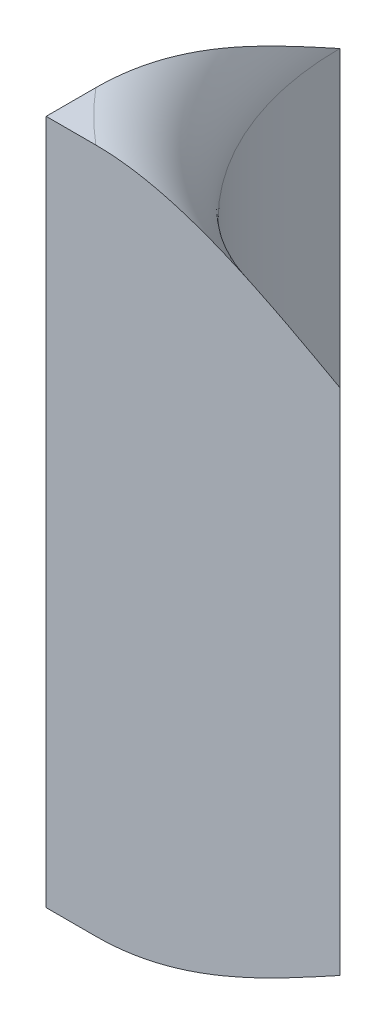
ISO-10303-21;
HEADER;
FILE_DESCRIPTION(('STEP AP214'),'2;1');
FILE_NAME('part.step','',(''),(''),'','','');
FILE_SCHEMA(('AUTOMOTIVE_DESIGN { 1 0 10303 214 1 1 1 1 }'));
ENDSEC;
DATA;
#1=APPLICATION_CONTEXT('core data for automotive mechanical design processes');
#2=APPLICATION_PROTOCOL_DEFINITION('international standard','automotive_design',2000,#1);
#3=PRODUCT_CONTEXT('',#1,'mechanical');
#4=PRODUCT('Part','Part','',(#3));
#5=PRODUCT_RELATED_PRODUCT_CATEGORY('part','',(#4));
#6=PRODUCT_DEFINITION_FORMATION('','',#4);
#7=PRODUCT_DEFINITION_CONTEXT('part definition',#1,'design');
#8=PRODUCT_DEFINITION('design','',#6,#7);
#9=PRODUCT_DEFINITION_SHAPE('','',#8);
#10=(LENGTH_UNIT() NAMED_UNIT(*) SI_UNIT(.MILLI.,.METRE.));
#11=(NAMED_UNIT(*) PLANE_ANGLE_UNIT() SI_UNIT($,.RADIAN.));
#12=(NAMED_UNIT(*) SI_UNIT($,.STERADIAN.) SOLID_ANGLE_UNIT());
#13=UNCERTAINTY_MEASURE_WITH_UNIT(LENGTH_MEASURE(1.E-05),#10,'distance_accuracy_value','');
#14=(GEOMETRIC_REPRESENTATION_CONTEXT(3) GLOBAL_UNCERTAINTY_ASSIGNED_CONTEXT((#13)) GLOBAL_UNIT_ASSIGNED_CONTEXT((#10,
#11,#12)) REPRESENTATION_CONTEXT('',''));
#15=CARTESIAN_POINT('',(0.,0.,0.));
#16=DIRECTION('',(0.,0.,1.));
#17=DIRECTION('',(1.,0.,0.));
#18=AXIS2_PLACEMENT_3D('',#15,#16,#17);
#19=CARTESIAN_POINT('',(0.899999999999998,2.46,-7.3));
#20=DIRECTION('',(0.,1.,0.));
#21=DIRECTION('',(0.,0.,1.));
#22=AXIS2_PLACEMENT_3D('',#19,#20,#21);
#23=TOROIDAL_SURFACE('',#22,0.389999999999998,0.0899999999999998);
#24=CARTESIAN_POINT('',(0.6,2.55,-7.05080128411138));
#25=CARTESIAN_POINT('',(0.6,2.54996873881584,-7.06539050320358));
#26=CARTESIAN_POINT('',(0.6,2.54856309488377,-7.07987147393059));
#27=CARTESIAN_POINT('',(0.6,2.54368423695863,-7.10829216976645));
#28=CARTESIAN_POINT('',(0.6,2.54023956259986,-7.12223658857574));
#29=CARTESIAN_POINT('',(0.6,2.52752219042688,-7.16420253695043));
#30=CARTESIAN_POINT('',(0.6,2.515942208103,-7.19147802039733));
#31=CARTESIAN_POINT('',(0.6,2.49015615109007,-7.24483565452281));
#32=CARTESIAN_POINT('',(0.599999999999999,2.47593214013189,-7.27090803790901));
#33=CARTESIAN_POINT('',(0.6,2.46110939531162,-7.29797451018031));
#34=CARTESIAN_POINT('',(0.6,2.46055469450969,-7.29898724918841));
#35=CARTESIAN_POINT('',(0.6,2.46,-7.3));
#36=B_SPLINE_CURVE_WITH_KNOTS('',3,(#24,#25,#26,#27,#28,#29,#30,#31,#32,#33,#34,#35),
.UNSPECIFIED.,.F.,.F.,(4,2,2,2,2,4),(0.,0.0435527295939666,0.0865098187320564,0.17500096336577,
0.264115894109952,0.267579995726727),.UNSPECIFIED.);
#37=CARTESIAN_POINT('',(0.6,2.55,-7.05080128411192));
#38=VERTEX_POINT('',#37);
#39=CARTESIAN_POINT('',(0.6,2.46,-7.3));
#40=VERTEX_POINT('',#39);
#41=EDGE_CURVE('E67',#38,#40,#36,.T.);
#42=ORIENTED_EDGE('',*,*,#41,.F.);
#43=CARTESIAN_POINT('',(0.899999999999998,2.55,-7.3));
#44=DIRECTION('',(0.,1.,0.));
#45=DIRECTION('',(0.,0.,1.));
#46=AXIS2_PLACEMENT_3D('',#43,#44,#45);
#47=CIRCLE('',#46,0.39);
#48=CARTESIAN_POINT('',(0.650801284112227,2.55,-7.));
#49=VERTEX_POINT('',#48);
#50=EDGE_CURVE('E21',#49,#38,#47,.F.);
#51=ORIENTED_EDGE('',*,*,#50,.F.);
#52=CARTESIAN_POINT('',(0.899999999999998,2.46,-7.));
#53=CARTESIAN_POINT('',(0.89898725661567,2.46055469331149,-7.));
#54=CARTESIAN_POINT('',(0.89797451732508,2.46110939416546,-7.));
#55=CARTESIAN_POINT('',(0.870492029190443,2.47615989168935,-7.));
#56=CARTESIAN_POINT('',(0.843998347949796,2.49061098047862,-7.));
#57=CARTESIAN_POINT('',(0.789677174911872,2.51675946724636,-7.));
#58=CARTESIAN_POINT('',(0.761855684111753,2.52846806008301,-7.));
#59=CARTESIAN_POINT('',(0.713737421333795,2.54263860606332,-7.));
#60=CARTESIAN_POINT('',(0.694027278119801,2.54688228554532,-7.));
#61=CARTESIAN_POINT('',(0.664024458957082,2.54981614838479,-7.));
#62=CARTESIAN_POINT('',(0.653905975180585,2.55021635400833,-7.));
#63=CARTESIAN_POINT('',(0.633709860349571,2.54955798089519,-7.));
#64=CARTESIAN_POINT('',(0.623632190714962,2.54850159887963,-7.));
#65=CARTESIAN_POINT('',(0.606849795189301,2.54519918623928,-7.));
#66=CARTESIAN_POINT('',(0.600054941578323,2.5434150242651,-7.));
#67=CARTESIAN_POINT('',(0.586796003818043,2.53886646101217,-7.));
#68=CARTESIAN_POINT('',(0.580331618137324,2.53610297225817,-7.));
#69=CARTESIAN_POINT('',(0.569145675850515,2.53012138519625,-7.));
#70=CARTESIAN_POINT('',(0.564325822863426,2.52708831558089,-7.));
#71=CARTESIAN_POINT('',(0.555238755963973,2.52028079794345,-7.));
#72=CARTESIAN_POINT('',(0.550970850404855,2.51650729299449,-7.));
#73=CARTESIAN_POINT('',(0.543952593766598,2.50903441492667,-7.));
#74=CARTESIAN_POINT('',(0.541068318756381,2.5054611748476,-7.));
#75=CARTESIAN_POINT('',(0.535926389086217,2.49788615695023,-7.));
#76=CARTESIAN_POINT('',(0.533668467919015,2.49388456239999,-7.));
#77=CARTESIAN_POINT('',(0.529891428907988,2.4855116190311,-7.));
#78=CARTESIAN_POINT('',(0.528377215587005,2.48113803302174,-7.));
#79=CARTESIAN_POINT('',(0.526212037434973,2.4721811284973,-7.));
#80=CARTESIAN_POINT('',(0.525560657993527,2.46759791181045,-7.));
#81=CARTESIAN_POINT('',(0.525189588582738,2.4589137667806,-7.));
#82=CARTESIAN_POINT('',(0.525373142459925,2.45481671703714,-7.));
#83=CARTESIAN_POINT('',(0.526443915780497,2.44671856100796,-7.));
#84=CARTESIAN_POINT('',(0.527330688055962,2.44271739541587,-7.));
#85=CARTESIAN_POINT('',(0.52972859349771,2.43501262320044,-7.));
#86=CARTESIAN_POINT('',(0.531224520104254,2.43130422631036,-7.));
#87=CARTESIAN_POINT('',(0.53476988704398,2.42415641295072,-7.));
#88=CARTESIAN_POINT('',(0.536820278802693,2.4207174720548,-7.));
#89=CARTESIAN_POINT('',(0.541601274235801,2.4138664688397,-7.));
#90=CARTESIAN_POINT('',(0.544377293154097,2.41048640398364,-7.));
#91=CARTESIAN_POINT('',(0.55036767495299,2.4041646567645,-7.));
#92=CARTESIAN_POINT('',(0.553580180020798,2.40122122144443,-7.));
#93=CARTESIAN_POINT('',(0.556962532803208,2.39850407393579,-7.));
#94=B_SPLINE_CURVE_WITH_KNOTS('',3,(#52,#53,#54,#55,#56,#57,#58,#59,#60,#61,#62,#63,#64,#65,#66,
#67,#68,#69,#70,#71,#72,#73,#74,#75,#76,#77,#78,#79,#80,#81,#82,#83,#84,#85,#86,#87,#88,#89,#90,
#91,#92,#93),.UNSPECIFIED.,.F.,.F.,(4,2,2,2,2,2,2,2,2,2,2,2,2,2,2,2,2,2,2,2,4),(0.,
0.00346410161608666,0.0940013231416879,0.184162267738062,0.244240211028066,0.274541767257815,
0.304797674800989,0.325813063735658,0.346808922053302,0.36383106331407,0.380831663025104,
0.394552608315526,0.408267706495753,0.422072076080095,0.435869809956166,0.448112045059994,
0.460346501713522,0.472292633881971,0.48425939634464,0.497334648987101,0.510355897946322),.UNSPECIFIED.);
#95=CARTESIAN_POINT('',(0.899999999999995,2.46,-7.));
#96=VERTEX_POINT('',#95);
#97=EDGE_CURVE('E64',#96,#49,#94,.T.);
#98=ORIENTED_EDGE('',*,*,#97,.F.);
#99=CARTESIAN_POINT('',(0.899999999999999,2.46,-7.3));
#100=DIRECTION('',(0.,1.,0.));
#101=DIRECTION('',(0.,0.,1.));
#102=AXIS2_PLACEMENT_3D('',#99,#100,#101);
#103=CIRCLE('',#102,0.299999999999999);
#104=EDGE_CURVE('E71',#40,#96,#103,.T.);
#105=ORIENTED_EDGE('',*,*,#104,.F.);
#106=EDGE_LOOP('',(#42,#51,#98,#105));
#107=FACE_BOUND('',#106,.T.);
#108=ADVANCED_FACE('F17',(#107),#23,.T.);
#109=CARTESIAN_POINT('',(0.599,2.55,-7.051801284111));
#110=DIRECTION('',(0.,1.,0.));
#111=DIRECTION('',(0.,0.,1.));
#112=AXIS2_PLACEMENT_3D('',#109,#110,#111);
#113=PLANE('',#112);
#114=DIRECTION('',(-1.,0.,0.));
#115=VECTOR('',#114,1.);
#116=CARTESIAN_POINT('',(0.75,2.55,-7.));
#117=LINE('',#116,#115);
#118=CARTESIAN_POINT('',(0.6,2.55,-7.));
#119=VERTEX_POINT('',#118);
#120=EDGE_CURVE('E73',#49,#119,#117,.T.);
#121=ORIENTED_EDGE('',*,*,#120,.F.);
#122=ORIENTED_EDGE('',*,*,#50,.T.);
#123=DIRECTION('',(0.,0.,-1.));
#124=VECTOR('',#123,1.);
#125=CARTESIAN_POINT('',(0.6,2.55,-7.15));
#126=LINE('',#125,#124);
#127=EDGE_CURVE('E75',#119,#38,#126,.T.);
#128=ORIENTED_EDGE('',*,*,#127,.F.);
#129=EDGE_LOOP('',(#121,#122,#128));
#130=FACE_BOUND('',#129,.T.);
#131=ADVANCED_FACE('F74',(#130),#113,.T.);
#132=CARTESIAN_POINT('',(0.899999999999999,2.46,-7.3));
#133=DIRECTION('',(0.,-1.,0.));
#134=DIRECTION('',(0.,0.,-1.));
#135=AXIS2_PLACEMENT_3D('',#132,#133,#134);
#136=CYLINDRICAL_SURFACE('',#135,0.299999999999999);
#137=CARTESIAN_POINT('',(0.899999999999999,1.94,-7.3));
#138=DIRECTION('',(0.,1.,0.));
#139=DIRECTION('',(0.,0.,1.));
#140=AXIS2_PLACEMENT_3D('',#137,#138,#139);
#141=CIRCLE('',#140,0.299999999999999);
#142=CARTESIAN_POINT('',(0.6,1.94,-7.3));
#143=VERTEX_POINT('',#142);
#144=CARTESIAN_POINT('',(0.9,1.94,-7.));
#145=VERTEX_POINT('',#144);
#146=EDGE_CURVE('E122',#143,#145,#141,.T.);
#147=ORIENTED_EDGE('',*,*,#146,.F.);
#148=DIRECTION('',(0.,-1.,0.));
#149=VECTOR('',#148,1.);
#150=CARTESIAN_POINT('',(0.6,2.20000000000024,-7.3));
#151=LINE('',#150,#149);
#152=EDGE_CURVE('E82',#40,#143,#151,.T.);
#153=ORIENTED_EDGE('',*,*,#152,.F.);
#154=ORIENTED_EDGE('',*,*,#104,.T.);
#155=DIRECTION('',(0.,1.,0.));
#156=VECTOR('',#155,1.);
#157=CARTESIAN_POINT('',(0.9,2.19999999999995,-7.));
#158=LINE('',#157,#156);
#159=EDGE_CURVE('E78',#145,#96,#158,.T.);
#160=ORIENTED_EDGE('',*,*,#159,.F.);
#161=EDGE_LOOP('',(#147,#153,#154,#160));
#162=FACE_BOUND('',#161,.T.);
#163=ADVANCED_FACE('F102',(#162),#136,.F.);
#164=CARTESIAN_POINT('',(0.599,2.55100000000009,-7.));
#165=DIRECTION('',(0.,0.,1.));
#166=DIRECTION('',(0.,-1.,0.));
#167=AXIS2_PLACEMENT_3D('',#164,#165,#166);
#168=PLANE('',#167);
#169=ORIENTED_EDGE('',*,*,#159,.T.);
#170=ORIENTED_EDGE('',*,*,#97,.T.);
#171=ORIENTED_EDGE('',*,*,#120,.T.);
#172=DIRECTION('',(0.,1.,0.));
#173=VECTOR('',#172,1.);
#174=CARTESIAN_POINT('',(0.6,2.20000000000024,-7.));
#175=LINE('',#174,#173);
#176=CARTESIAN_POINT('',(0.6,1.85,-7.));
#177=VERTEX_POINT('',#176);
#178=EDGE_CURVE('E133',#177,#119,#175,.T.);
#179=ORIENTED_EDGE('',*,*,#178,.F.);
#180=DIRECTION('',(-1.,0.,0.));
#181=VECTOR('',#180,1.);
#182=CARTESIAN_POINT('',(0.625400642056094,1.85,-7.));
#183=LINE('',#182,#181);
#184=CARTESIAN_POINT('',(0.65080128411216,1.84999999999969,-7.));
#185=VERTEX_POINT('',#184);
#186=EDGE_CURVE('E120',#185,#177,#183,.T.);
#187=ORIENTED_EDGE('',*,*,#186,.F.);
#188=CARTESIAN_POINT('',(0.899999999999999,1.94,-7.));
#189=CARTESIAN_POINT('',(0.898987256615678,1.9394453066885,-7.));
#190=CARTESIAN_POINT('',(0.897974517325094,1.93889060583452,-7.));
#191=CARTESIAN_POINT('',(0.870492029190653,1.92384010831033,-6.99999999999999));
#192=CARTESIAN_POINT('',(0.8439983479499,1.90938901952132,-7.));
#193=CARTESIAN_POINT('',(0.789677174911932,1.88324053275377,-7.));
#194=CARTESIAN_POINT('',(0.76185568411187,1.87153193991706,-7.));
#195=CARTESIAN_POINT('',(0.713737421333924,1.8573613939367,-7.));
#196=CARTESIAN_POINT('',(0.694027278119896,1.85311771445469,-7.));
#197=CARTESIAN_POINT('',(0.664024458957132,1.85018385161522,-7.));
#198=CARTESIAN_POINT('',(0.653905975180621,1.84978364599167,-7.));
#199=CARTESIAN_POINT('',(0.633709860349576,1.8504420191048,-7.));
#200=CARTESIAN_POINT('',(0.623632190714951,1.85149840112037,-7.));
#201=CARTESIAN_POINT('',(0.606849795189277,1.85480081376073,-7.));
#202=CARTESIAN_POINT('',(0.600054941578301,1.85658497573491,-7.));
#203=CARTESIAN_POINT('',(0.586796003818025,1.86113353898784,-7.));
#204=CARTESIAN_POINT('',(0.580331618137308,1.86389702774184,-7.));
#205=CARTESIAN_POINT('',(0.569145675850502,1.86987861480375,-7.));
#206=CARTESIAN_POINT('',(0.564325822863414,1.87291168441911,-7.));
#207=CARTESIAN_POINT('',(0.555238755963963,1.87971920205656,-7.));
#208=CARTESIAN_POINT('',(0.550970850404846,1.88349270700552,-7.));
#209=CARTESIAN_POINT('',(0.54395259376659,1.89096558507334,-7.));
#210=CARTESIAN_POINT('',(0.541068318756374,1.89453882515241,-7.));
#211=CARTESIAN_POINT('',(0.535926389086211,1.90211384304978,-7.));
#212=CARTESIAN_POINT('',(0.533668467919011,1.90611543760003,-7.));
#213=CARTESIAN_POINT('',(0.529891428907985,1.91448838096891,-7.));
#214=CARTESIAN_POINT('',(0.528377215587003,1.91886196697827,-7.));
#215=CARTESIAN_POINT('',(0.526212037434972,1.92781887150271,-7.));
#216=CARTESIAN_POINT('',(0.525560657993526,1.93240208818956,-7.));
#217=CARTESIAN_POINT('',(0.525189588582739,1.94108623321941,-7.));
#218=CARTESIAN_POINT('',(0.525373142459927,1.94518328296287,-7.));
#219=CARTESIAN_POINT('',(0.526443915780499,1.95328143899205,-7.));
#220=CARTESIAN_POINT('',(0.527330688055965,1.95728260458414,-7.));
#221=CARTESIAN_POINT('',(0.529728593497714,1.96498737679956,-7.));
#222=CARTESIAN_POINT('',(0.531224520104258,1.96869577368965,-7.));
#223=CARTESIAN_POINT('',(0.534769887043985,1.97584358704929,-7.));
#224=CARTESIAN_POINT('',(0.536820278802699,1.97928252794521,-7.));
#225=CARTESIAN_POINT('',(0.541601274235807,1.98613353116031,-7.));
#226=CARTESIAN_POINT('',(0.544377293154104,1.98951359601637,-7.));
#227=CARTESIAN_POINT('',(0.550367674952998,1.99583534323551,-7.));
#228=CARTESIAN_POINT('',(0.553580180020806,1.99877877855558,-7.));
#229=CARTESIAN_POINT('',(0.556962532803216,2.00149592606422,-7.));
#230=B_SPLINE_CURVE_WITH_KNOTS('',3,(#188,#189,#190,#191,#192,#193,#194,#195,#196,#197,#198,
#199,#200,#201,#202,#203,#204,#205,#206,#207,#208,#209,#210,#211,#212,#213,#214,#215,#216,#217,
#218,#219,#220,#221,#222,#223,#224,#225,#226,#227,#228,#229),.UNSPECIFIED.,.F.,.F.,(4,2,2,2,2,2,
2,2,2,2,2,2,2,2,2,2,2,2,2,2,4),(0.,0.00346410161608675,0.0940013231415936,0.184162267737909,
0.244240211028003,0.274541767257796,0.304797674801017,0.325813063735682,0.34680892205332,
0.363831063314086,0.380831663025118,0.39455260831554,0.408267706495766,0.422072076080106,
0.435869809956176,0.448112045060005,0.460346501713532,0.472292633881981,0.48425939634465,
0.497334648987112,0.510355897946333),.UNSPECIFIED.);
#231=EDGE_CURVE('E132',#145,#185,#230,.T.);
#232=ORIENTED_EDGE('',*,*,#231,.F.);
#233=EDGE_LOOP('',(#169,#170,#171,#179,#187,#232));
#234=FACE_BOUND('',#233,.T.);
#235=ADVANCED_FACE('F80',(#234),#168,.T.);
#236=CARTESIAN_POINT('',(0.6,1.84899999999953,-6.999));
#237=DIRECTION('',(-1.,0.,0.));
#238=DIRECTION('',(0.,1.,0.));
#239=AXIS2_PLACEMENT_3D('',#236,#237,#238);
#240=PLANE('',#239);
#241=ORIENTED_EDGE('',*,*,#178,.T.);
#242=ORIENTED_EDGE('',*,*,#127,.T.);
#243=ORIENTED_EDGE('',*,*,#41,.T.);
#244=ORIENTED_EDGE('',*,*,#152,.T.);
#245=CARTESIAN_POINT('',(0.6,1.85,-7.05080128411138));
#246=CARTESIAN_POINT('',(0.6,1.85003126118416,-7.06539050320358));
#247=CARTESIAN_POINT('',(0.6,1.85143690511623,-7.07987147393058));
#248=CARTESIAN_POINT('',(0.6,1.85631576304137,-7.10829216976645));
#249=CARTESIAN_POINT('',(0.6,1.85976043740014,-7.12223658857575));
#250=CARTESIAN_POINT('',(0.6,1.87247780957313,-7.16420253695043));
#251=CARTESIAN_POINT('',(0.6,1.88405779189701,-7.19147802039733));
#252=CARTESIAN_POINT('',(0.6,1.90984384890992,-7.24483565452282));
#253=CARTESIAN_POINT('',(0.599999999999999,1.92406785986808,-7.27090803790903));
#254=CARTESIAN_POINT('',(0.6,1.93889060468838,-7.29797451018032));
#255=CARTESIAN_POINT('',(0.6,1.93944530549031,-7.29898724918841));
#256=CARTESIAN_POINT('',(0.6,1.94,-7.3));
#257=B_SPLINE_CURVE_WITH_KNOTS('',3,(#245,#246,#247,#248,#249,#250,#251,#252,#253,#254,#255,
#256),.UNSPECIFIED.,.F.,.F.,(4,2,2,2,2,4),(0.,0.0435527295939639,0.0865098187320572,
0.175000963365774,0.264115894109955,0.267579995726729),.UNSPECIFIED.);
#258=CARTESIAN_POINT('',(0.6,1.85,-7.05080128411192));
#259=VERTEX_POINT('',#258);
#260=EDGE_CURVE('E36',#259,#143,#257,.T.);
#261=ORIENTED_EDGE('',*,*,#260,.F.);
#262=DIRECTION('',(0.,0.,-1.));
#263=VECTOR('',#262,1.);
#264=CARTESIAN_POINT('',(0.6,1.85,-7.0254006420555));
#265=LINE('',#264,#263);
#266=EDGE_CURVE('E27',#177,#259,#265,.T.);
#267=ORIENTED_EDGE('',*,*,#266,.F.);
#268=EDGE_LOOP('',(#241,#242,#243,#244,#261,#267));
#269=FACE_BOUND('',#268,.T.);
#270=ADVANCED_FACE('F109',(#269),#240,.T.);
#271=CARTESIAN_POINT('',(0.899999999999999,1.94,-7.3));
#272=DIRECTION('',(0.,-1.,0.));
#273=DIRECTION('',(0.,0.,-1.));
#274=AXIS2_PLACEMENT_3D('',#271,#272,#273);
#275=TOROIDAL_SURFACE('',#274,0.389999999999999,0.09);
#276=ORIENTED_EDGE('',*,*,#260,.T.);
#277=ORIENTED_EDGE('',*,*,#146,.T.);
#278=ORIENTED_EDGE('',*,*,#231,.T.);
#279=CARTESIAN_POINT('',(0.899999999999999,1.85,-7.3));
#280=DIRECTION('',(0.,-1.,0.));
#281=DIRECTION('',(0.,0.,-1.));
#282=AXIS2_PLACEMENT_3D('',#279,#280,#281);
#283=CIRCLE('',#282,0.390000000000003);
#284=EDGE_CURVE('E11',#259,#185,#283,.F.);
#285=ORIENTED_EDGE('',*,*,#284,.F.);
#286=EDGE_LOOP('',(#276,#277,#278,#285));
#287=FACE_BOUND('',#286,.T.);
#288=ADVANCED_FACE('F112',(#287),#275,.T.);
#289=CARTESIAN_POINT('',(0.599,1.85,-6.999));
#290=DIRECTION('',(0.,-1.,0.));
#291=DIRECTION('',(0.,0.,-1.));
#292=AXIS2_PLACEMENT_3D('',#289,#290,#291);
#293=PLANE('',#292);
#294=ORIENTED_EDGE('',*,*,#266,.T.);
#295=ORIENTED_EDGE('',*,*,#284,.T.);
#296=ORIENTED_EDGE('',*,*,#186,.T.);
#297=EDGE_LOOP('',(#294,#295,#296));
#298=FACE_BOUND('',#297,.T.);
#299=ADVANCED_FACE('F19',(#298),#293,.T.);
#300=CLOSED_SHELL('',(#108,#131,#163,#235,#270,#288,#299));
#301=MANIFOLD_SOLID_BREP('B1',#300);
#302=ADVANCED_BREP_SHAPE_REPRESENTATION('',(#18,#301),#14);
#303=SHAPE_DEFINITION_REPRESENTATION(#9,#302);
ENDSEC;
END-ISO-10303-21;
